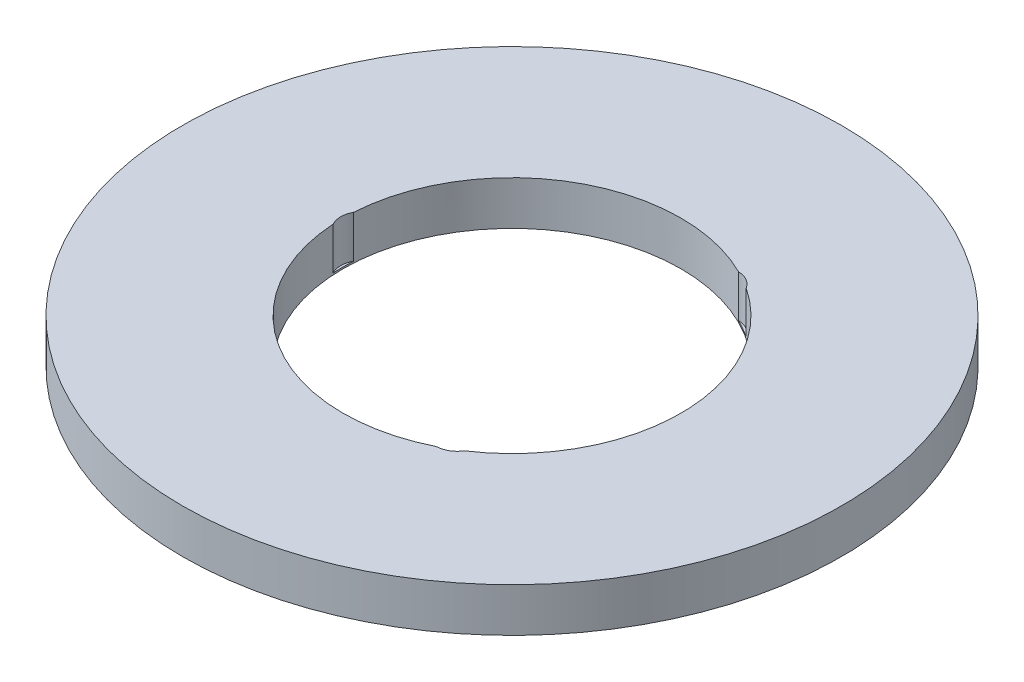
ISO-10303-21;
HEADER;
FILE_DESCRIPTION(('STEP AP214'),'2;1');
FILE_NAME('part.step','',(''),(''),'','','');
FILE_SCHEMA(('AUTOMOTIVE_DESIGN { 1 0 10303 214 1 1 1 1 }'));
ENDSEC;
DATA;
#1=APPLICATION_CONTEXT('core data for automotive mechanical design processes');
#2=APPLICATION_PROTOCOL_DEFINITION('international standard','automotive_design',2000,#1);
#3=PRODUCT_CONTEXT('',#1,'mechanical');
#4=PRODUCT('Part','Part','',(#3));
#5=PRODUCT_RELATED_PRODUCT_CATEGORY('part','',(#4));
#6=PRODUCT_DEFINITION_FORMATION('','',#4);
#7=PRODUCT_DEFINITION_CONTEXT('part definition',#1,'design');
#8=PRODUCT_DEFINITION('design','',#6,#7);
#9=PRODUCT_DEFINITION_SHAPE('','',#8);
#10=(LENGTH_UNIT() NAMED_UNIT(*) SI_UNIT(.MILLI.,.METRE.));
#11=(NAMED_UNIT(*) PLANE_ANGLE_UNIT() SI_UNIT($,.RADIAN.));
#12=(NAMED_UNIT(*) SI_UNIT($,.STERADIAN.) SOLID_ANGLE_UNIT());
#13=UNCERTAINTY_MEASURE_WITH_UNIT(LENGTH_MEASURE(1.E-05),#10,'distance_accuracy_value','');
#14=(GEOMETRIC_REPRESENTATION_CONTEXT(3) GLOBAL_UNCERTAINTY_ASSIGNED_CONTEXT((#13)) GLOBAL_UNIT_ASSIGNED_CONTEXT((#10,
#11,#12)) REPRESENTATION_CONTEXT('',''));
#15=CARTESIAN_POINT('',(0.,0.,0.));
#16=DIRECTION('',(0.,0.,1.));
#17=DIRECTION('',(1.,0.,0.));
#18=AXIS2_PLACEMENT_3D('',#15,#16,#17);
#19=CARTESIAN_POINT('',(0.,13.,0.));
#20=DIRECTION('',(0.,-1.,0.));
#21=DIRECTION('',(0.,0.,-1.));
#22=AXIS2_PLACEMENT_3D('',#19,#20,#21);
#23=CYLINDRICAL_SURFACE('',#22,97.5);
#24=CARTESIAN_POINT('',(0.,13.,0.));
#25=DIRECTION('',(0.,1.,0.));
#26=DIRECTION('',(0.,0.,1.));
#27=AXIS2_PLACEMENT_3D('',#24,#25,#26);
#28=CIRCLE('',#27,97.5);
#29=CARTESIAN_POINT('',(0.,13.,-97.5));
#30=VERTEX_POINT('',#29);
#31=EDGE_CURVE('E130',#30,#30,#28,.T.);
#32=CARTESIAN_POINT('',(0.,0.,0.));
#33=DIRECTION('',(0.,1.,0.));
#34=DIRECTION('',(0.,0.,1.));
#35=AXIS2_PLACEMENT_3D('',#32,#33,#34);
#36=CIRCLE('',#35,97.5);
#37=CARTESIAN_POINT('',(0.,0.,-97.5));
#38=VERTEX_POINT('',#37);
#39=EDGE_CURVE('E117',#38,#38,#36,.T.);
#40=CARTESIAN_POINT('',(0.,13.,-97.5));
#41=CARTESIAN_POINT('',(0.,12.8645833333333,-97.5));
#42=CARTESIAN_POINT('',(0.,12.7291666666667,-97.5));
#43=CARTESIAN_POINT('',(0.,12.4583333333333,-97.5));
#44=CARTESIAN_POINT('',(0.,12.3229166666667,-97.5));
#45=CARTESIAN_POINT('',(0.,12.0520833333333,-97.5));
#46=CARTESIAN_POINT('',(0.,11.9166666666667,-97.5));
#47=CARTESIAN_POINT('',(0.,11.6458333333333,-97.5));
#48=CARTESIAN_POINT('',(0.,11.5104166666667,-97.5));
#49=CARTESIAN_POINT('',(0.,11.2395833333333,-97.5));
#50=CARTESIAN_POINT('',(0.,11.1041666666667,-97.5));
#51=CARTESIAN_POINT('',(0.,10.8333333333333,-97.5));
#52=CARTESIAN_POINT('',(0.,10.6979166666667,-97.5));
#53=CARTESIAN_POINT('',(0.,10.4270833333333,-97.5));
#54=CARTESIAN_POINT('',(0.,10.2916666666667,-97.5));
#55=CARTESIAN_POINT('',(0.,10.0208333333333,-97.5));
#56=CARTESIAN_POINT('',(0.,9.88541666666667,-97.5));
#57=CARTESIAN_POINT('',(0.,9.61458333333333,-97.5));
#58=CARTESIAN_POINT('',(0.,9.47916666666667,-97.5));
#59=CARTESIAN_POINT('',(0.,9.20833333333333,-97.5));
#60=CARTESIAN_POINT('',(0.,9.07291666666667,-97.5));
#61=CARTESIAN_POINT('',(0.,8.80208333333333,-97.5));
#62=CARTESIAN_POINT('',(0.,8.66666666666667,-97.5));
#63=CARTESIAN_POINT('',(0.,8.39583333333333,-97.5));
#64=CARTESIAN_POINT('',(0.,8.26041666666667,-97.5));
#65=CARTESIAN_POINT('',(0.,7.98958333333333,-97.5));
#66=CARTESIAN_POINT('',(0.,7.85416666666667,-97.5));
#67=CARTESIAN_POINT('',(0.,7.58333333333333,-97.5));
#68=CARTESIAN_POINT('',(0.,7.44791666666667,-97.5));
#69=CARTESIAN_POINT('',(0.,7.17708333333333,-97.5));
#70=CARTESIAN_POINT('',(0.,7.04166666666667,-97.5));
#71=CARTESIAN_POINT('',(0.,6.77083333333333,-97.5));
#72=CARTESIAN_POINT('',(0.,6.63541666666667,-97.5));
#73=CARTESIAN_POINT('',(0.,6.36458333333333,-97.5));
#74=CARTESIAN_POINT('',(0.,6.22916666666667,-97.5));
#75=CARTESIAN_POINT('',(0.,5.95833333333333,-97.5));
#76=CARTESIAN_POINT('',(0.,5.82291666666667,-97.5));
#77=CARTESIAN_POINT('',(0.,5.55208333333333,-97.5));
#78=CARTESIAN_POINT('',(0.,5.41666666666667,-97.5));
#79=CARTESIAN_POINT('',(0.,5.14583333333333,-97.5));
#80=CARTESIAN_POINT('',(0.,5.01041666666667,-97.5));
#81=CARTESIAN_POINT('',(0.,4.73958333333333,-97.5));
#82=CARTESIAN_POINT('',(0.,4.60416666666667,-97.5));
#83=CARTESIAN_POINT('',(0.,4.33333333333333,-97.5));
#84=CARTESIAN_POINT('',(0.,4.19791666666667,-97.5));
#85=CARTESIAN_POINT('',(0.,3.92708333333333,-97.5));
#86=CARTESIAN_POINT('',(0.,3.79166666666667,-97.5));
#87=CARTESIAN_POINT('',(0.,3.52083333333333,-97.5));
#88=CARTESIAN_POINT('',(0.,3.38541666666667,-97.5));
#89=CARTESIAN_POINT('',(0.,3.11458333333333,-97.5));
#90=CARTESIAN_POINT('',(0.,2.97916666666667,-97.5));
#91=CARTESIAN_POINT('',(0.,2.70833333333333,-97.5));
#92=CARTESIAN_POINT('',(0.,2.57291666666667,-97.5));
#93=CARTESIAN_POINT('',(0.,2.30208333333333,-97.5));
#94=CARTESIAN_POINT('',(0.,2.16666666666667,-97.5));
#95=CARTESIAN_POINT('',(0.,1.89583333333333,-97.5));
#96=CARTESIAN_POINT('',(0.,1.76041666666667,-97.5));
#97=CARTESIAN_POINT('',(0.,1.48958333333333,-97.5));
#98=CARTESIAN_POINT('',(0.,1.35416666666667,-97.5));
#99=CARTESIAN_POINT('',(0.,1.08333333333333,-97.5));
#100=CARTESIAN_POINT('',(0.,0.947916666666667,-97.5));
#101=CARTESIAN_POINT('',(0.,0.677083333333334,-97.5));
#102=CARTESIAN_POINT('',(0.,0.541666666666667,-97.5));
#103=CARTESIAN_POINT('',(0.,0.270833333333334,-97.5));
#104=CARTESIAN_POINT('',(0.,0.135416666666667,-97.5));
#105=CARTESIAN_POINT('',(0.,0.,-97.5));
#106=B_SPLINE_CURVE_WITH_KNOTS('',3,(#40,#41,#42,#43,#44,#45,#46,#47,#48,#49,#50,#51,#52,#53,
#54,#55,#56,#57,#58,#59,#60,#61,#62,#63,#64,#65,#66,#67,#68,#69,#70,#71,#72,#73,#74,#75,#76,#77,
#78,#79,#80,#81,#82,#83,#84,#85,#86,#87,#88,#89,#90,#91,#92,#93,#94,#95,#96,#97,#98,#99,#100,
#101,#102,#103,#104,#105),.UNSPECIFIED.,.F.,.F.,(4,2,2,2,2,2,2,2,2,2,2,2,2,2,2,2,2,2,2,2,2,2,2,
2,2,2,2,2,2,2,2,2,4),(0.,0.406249999999999,0.812499999999999,1.21875,1.625,2.03125,2.4375,
2.84375,3.25,3.65625,4.0625,4.46875,4.875,5.28125,5.6875,6.09375,6.5,6.90625,7.3125,7.71875,
8.125,8.53125,8.9375,9.34375,9.75,10.15625,10.5625,10.96875,11.375,11.78125,12.1875,12.59375,
13.),.UNSPECIFIED.);
#107=EDGE_CURVE('BSEAM39',#30,#38,#106,.T.);
#108=ORIENTED_EDGE('',*,*,#31,.F.);
#109=ORIENTED_EDGE('',*,*,#39,.T.);
#110=ORIENTED_EDGE('',*,*,#107,.T.);
#111=ORIENTED_EDGE('',*,*,#107,.F.);
#112=EDGE_LOOP('',(#108,#110,#109,#111));
#113=FACE_BOUND('',#112,.T.);
#114=ADVANCED_FACE('F39',(#113),#23,.T.);
#115=CARTESIAN_POINT('',(0.,13.,0.));
#116=DIRECTION('',(0.,1.,0.));
#117=DIRECTION('',(0.,0.,1.));
#118=AXIS2_PLACEMENT_3D('',#115,#116,#117);
#119=PLANE('',#118);
#120=CARTESIAN_POINT('',(22.118594173977,13.,38.3105289013248));
#121=DIRECTION('',(0.,1.,0.));
#122=DIRECTION('',(0.866025403784436,0.,-0.500000000000004));
#123=AXIS2_PLACEMENT_3D('',#120,#121,#122);
#124=CIRCLE('',#123,6.43417313353536);
#125=CARTESIAN_POINT('',(22.3202723115172,13.,44.7415404734763));
#126=VERTEX_POINT('',#125);
#127=CARTESIAN_POINT('',(27.5871744987219,13.,41.7006930778982));
#128=VERTEX_POINT('',#127);
#129=EDGE_CURVE('E148',#126,#128,#124,.T.);
#130=ORIENTED_EDGE('',*,*,#129,.F.);
#131=CARTESIAN_POINT('',(0.,13.,0.));
#132=DIRECTION('',(0.,1.,0.));
#133=DIRECTION('',(0.,0.,1.));
#134=AXIS2_PLACEMENT_3D('',#131,#132,#133);
#135=CIRCLE('',#134,50.);
#136=CARTESIAN_POINT('',(-49.9074468102387,13.,3.04084739557801));
#137=VERTEX_POINT('',#136);
#138=EDGE_CURVE('E113',#137,#126,#135,.T.);
#139=ORIENTED_EDGE('',*,*,#138,.F.);
#140=CARTESIAN_POINT('',(-44.2371883479537,13.,0.));
#141=DIRECTION('',(0.,1.,0.));
#142=DIRECTION('',(0.,0.,1.));
#143=AXIS2_PLACEMENT_3D('',#140,#141,#142);
#144=CIRCLE('',#143,6.43417313353536);
#145=CARTESIAN_POINT('',(-49.9074468102387,13.,-3.04084739557801));
#146=VERTEX_POINT('',#145);
#147=EDGE_CURVE('E125',#146,#137,#144,.T.);
#148=ORIENTED_EDGE('',*,*,#147,.F.);
#149=CARTESIAN_POINT('',(22.3202723115166,13.,-44.7415404734766));
#150=VERTEX_POINT('',#149);
#151=EDGE_CURVE('E107',#150,#146,#135,.T.);
#152=ORIENTED_EDGE('',*,*,#151,.F.);
#153=CARTESIAN_POINT('',(22.1185941739765,13.,-38.3105289013251));
#154=DIRECTION('',(0.,1.,0.));
#155=DIRECTION('',(-0.866025403784443,0.,-0.499999999999992));
#156=AXIS2_PLACEMENT_3D('',#153,#154,#155);
#157=CIRCLE('',#156,6.43417313353536);
#158=CARTESIAN_POINT('',(27.5871744987213,13.,-41.7006930778986));
#159=VERTEX_POINT('',#158);
#160=EDGE_CURVE('E95',#159,#150,#157,.T.);
#161=ORIENTED_EDGE('',*,*,#160,.F.);
#162=EDGE_CURVE('E106',#128,#159,#135,.T.);
#163=ORIENTED_EDGE('',*,*,#162,.F.);
#164=EDGE_LOOP('',(#130,#139,#148,#152,#161,#163));
#165=FACE_BOUND('',#164,.T.);
#166=ORIENTED_EDGE('',*,*,#31,.T.);
#167=EDGE_LOOP('',(#166));
#168=FACE_BOUND('',#167,.T.);
#169=ADVANCED_FACE('F102',(#165,#168),#119,.T.);
#170=CARTESIAN_POINT('',(0.,0.,0.));
#171=DIRECTION('',(0.,1.,0.));
#172=DIRECTION('',(0.,0.,1.));
#173=AXIS2_PLACEMENT_3D('',#170,#171,#172);
#174=PLANE('',#173);
#175=CARTESIAN_POINT('',(0.,0.,0.));
#176=DIRECTION('',(0.,1.,0.));
#177=DIRECTION('',(0.,0.,1.));
#178=AXIS2_PLACEMENT_3D('',#175,#176,#177);
#179=CIRCLE('',#178,50.);
#180=CARTESIAN_POINT('',(0.,0.,50.));
#181=VERTEX_POINT('',#180);
#182=EDGE_CURVE('E118',#181,#181,#179,.T.);
#183=ORIENTED_EDGE('',*,*,#182,.T.);
#184=EDGE_LOOP('',(#183));
#185=FACE_BOUND('',#184,.T.);
#186=ORIENTED_EDGE('',*,*,#39,.F.);
#187=EDGE_LOOP('',(#186));
#188=FACE_BOUND('',#187,.T.);
#189=ADVANCED_FACE('F161',(#185,#188),#174,.F.);
#190=CARTESIAN_POINT('',(0.,13.,0.));
#191=DIRECTION('',(0.,-1.,0.));
#192=DIRECTION('',(0.,0.,-1.));
#193=AXIS2_PLACEMENT_3D('',#190,#191,#192);
#194=CYLINDRICAL_SURFACE('',#193,50.);
#195=DIRECTION('',(0.,1.,0.));
#196=VECTOR('',#195,1.);
#197=CARTESIAN_POINT('',(22.3202723115172,6.73601059932428,44.7415404734763));
#198=LINE('',#197,#196);
#199=CARTESIAN_POINT('',(22.3202723115172,0.472021198648568,44.7415404734763));
#200=VERTEX_POINT('',#199);
#201=EDGE_CURVE('E11',#200,#126,#198,.T.);
#202=ORIENTED_EDGE('',*,*,#201,.F.);
#203=CARTESIAN_POINT('',(0.,0.472021198648568,0.));
#204=DIRECTION('',(0.,1.,0.));
#205=DIRECTION('',(0.,0.,1.));
#206=AXIS2_PLACEMENT_3D('',#203,#204,#205);
#207=CIRCLE('',#206,50.);
#208=CARTESIAN_POINT('',(27.5871744987219,0.472021198648568,41.7006930778982));
#209=VERTEX_POINT('',#208);
#210=EDGE_CURVE('E100',#200,#209,#207,.T.);
#211=ORIENTED_EDGE('',*,*,#210,.T.);
#212=DIRECTION('',(0.,1.,0.));
#213=VECTOR('',#212,1.);
#214=CARTESIAN_POINT('',(27.5871744987219,6.73601059932428,41.7006930778982));
#215=LINE('',#214,#213);
#216=EDGE_CURVE('E46',#128,#209,#215,.F.);
#217=ORIENTED_EDGE('',*,*,#216,.F.);
#218=ORIENTED_EDGE('',*,*,#162,.T.);
#219=DIRECTION('',(0.,1.,0.));
#220=VECTOR('',#219,1.);
#221=CARTESIAN_POINT('',(27.5871744987213,6.73601059932428,-41.7006930778986));
#222=LINE('',#221,#220);
#223=CARTESIAN_POINT('',(27.5871744987213,0.472021198648568,-41.7006930778986));
#224=VERTEX_POINT('',#223);
#225=EDGE_CURVE('E90',#224,#159,#222,.T.);
#226=ORIENTED_EDGE('',*,*,#225,.F.);
#227=CARTESIAN_POINT('',(0.,0.472021198648568,0.));
#228=DIRECTION('',(0.,1.,0.));
#229=DIRECTION('',(0.,0.,1.));
#230=AXIS2_PLACEMENT_3D('',#227,#228,#229);
#231=CIRCLE('',#230,50.);
#232=CARTESIAN_POINT('',(22.3202723115166,0.472021198648568,-44.7415404734766));
#233=VERTEX_POINT('',#232);
#234=EDGE_CURVE('E143',#224,#233,#231,.T.);
#235=ORIENTED_EDGE('',*,*,#234,.T.);
#236=DIRECTION('',(0.,1.,0.));
#237=VECTOR('',#236,1.);
#238=CARTESIAN_POINT('',(22.3202723115166,6.73601059932428,-44.7415404734766));
#239=LINE('',#238,#237);
#240=EDGE_CURVE('E98',#150,#233,#239,.F.);
#241=ORIENTED_EDGE('',*,*,#240,.F.);
#242=ORIENTED_EDGE('',*,*,#151,.T.);
#243=DIRECTION('',(0.,1.,0.));
#244=VECTOR('',#243,1.);
#245=CARTESIAN_POINT('',(-49.9074468102387,6.73601059932428,-3.04084739557804));
#246=LINE('',#245,#244);
#247=CARTESIAN_POINT('',(-49.9074468102387,0.472021198648568,-3.04084739557801));
#248=VERTEX_POINT('',#247);
#249=EDGE_CURVE('E137',#248,#146,#246,.T.);
#250=ORIENTED_EDGE('',*,*,#249,.F.);
#251=CARTESIAN_POINT('',(0.,0.472021198648568,0.));
#252=DIRECTION('',(0.,1.,0.));
#253=DIRECTION('',(0.,0.,1.));
#254=AXIS2_PLACEMENT_3D('',#251,#252,#253);
#255=CIRCLE('',#254,50.);
#256=CARTESIAN_POINT('',(-49.9074468102387,0.472021198648568,3.04084739557801));
#257=VERTEX_POINT('',#256);
#258=EDGE_CURVE('E128',#248,#257,#255,.T.);
#259=ORIENTED_EDGE('',*,*,#258,.T.);
#260=DIRECTION('',(0.,1.,0.));
#261=VECTOR('',#260,1.);
#262=CARTESIAN_POINT('',(-49.9074468102387,6.73601059932428,3.04084739557804));
#263=LINE('',#262,#261);
#264=EDGE_CURVE('E134',#137,#257,#263,.F.);
#265=ORIENTED_EDGE('',*,*,#264,.F.);
#266=ORIENTED_EDGE('',*,*,#138,.T.);
#267=EDGE_LOOP('',(#202,#211,#217,#218,#226,#235,#241,#242,#250,#259,#265,#266));
#268=FACE_BOUND('',#267,.T.);
#269=ORIENTED_EDGE('',*,*,#182,.F.);
#270=EDGE_LOOP('',(#269));
#271=FACE_BOUND('',#270,.T.);
#272=ADVANCED_FACE('F115',(#268,#271),#194,.F.);
#273=CARTESIAN_POINT('',(-44.2371883479537,0.472021198648568,0.));
#274=DIRECTION('',(0.,1.,0.));
#275=DIRECTION('',(0.,0.,1.));
#276=AXIS2_PLACEMENT_3D('',#273,#274,#275);
#277=CYLINDRICAL_SURFACE('',#276,6.43417313353536);
#278=ORIENTED_EDGE('',*,*,#249,.T.);
#279=ORIENTED_EDGE('',*,*,#147,.T.);
#280=ORIENTED_EDGE('',*,*,#264,.T.);
#281=CARTESIAN_POINT('',(-44.2371883479537,0.472021198648568,0.));
#282=DIRECTION('',(0.,1.,0.));
#283=DIRECTION('',(0.,0.,1.));
#284=AXIS2_PLACEMENT_3D('',#281,#282,#283);
#285=CIRCLE('',#284,6.43417313353536);
#286=EDGE_CURVE('E127',#248,#257,#285,.T.);
#287=ORIENTED_EDGE('',*,*,#286,.F.);
#288=EDGE_LOOP('',(#278,#279,#280,#287));
#289=FACE_BOUND('',#288,.T.);
#290=ADVANCED_FACE('F175',(#289),#277,.F.);
#291=CARTESIAN_POINT('',(-44.2371883479537,0.472021198648568,0.));
#292=DIRECTION('',(0.,1.,0.));
#293=DIRECTION('',(0.,0.,1.));
#294=AXIS2_PLACEMENT_3D('',#291,#292,#293);
#295=PLANE('',#294);
#296=ORIENTED_EDGE('',*,*,#286,.T.);
#297=ORIENTED_EDGE('',*,*,#258,.F.);
#298=EDGE_LOOP('',(#296,#297));
#299=FACE_BOUND('',#298,.T.);
#300=ADVANCED_FACE('F176',(#299),#295,.T.);
#301=CARTESIAN_POINT('',(22.1185941739765,0.472021198648568,-38.3105289013251));
#302=DIRECTION('',(0.,1.,0.));
#303=DIRECTION('',(0.,0.,1.));
#304=AXIS2_PLACEMENT_3D('',#301,#302,#303);
#305=CYLINDRICAL_SURFACE('',#304,6.43417313353536);
#306=ORIENTED_EDGE('',*,*,#225,.T.);
#307=ORIENTED_EDGE('',*,*,#160,.T.);
#308=ORIENTED_EDGE('',*,*,#240,.T.);
#309=CARTESIAN_POINT('',(22.1185941739765,0.472021198648568,-38.3105289013251));
#310=DIRECTION('',(0.,1.,0.));
#311=DIRECTION('',(-0.866025403784443,0.,-0.499999999999992));
#312=AXIS2_PLACEMENT_3D('',#309,#310,#311);
#313=CIRCLE('',#312,6.43417313353536);
#314=EDGE_CURVE('E56',#224,#233,#313,.T.);
#315=ORIENTED_EDGE('',*,*,#314,.F.);
#316=EDGE_LOOP('',(#306,#307,#308,#315));
#317=FACE_BOUND('',#316,.T.);
#318=ADVANCED_FACE('F93',(#317),#305,.F.);
#319=CARTESIAN_POINT('',(22.1185941739765,0.472021198648568,-38.3105289013251));
#320=DIRECTION('',(0.,1.,0.));
#321=DIRECTION('',(-0.866025403784443,0.,-0.499999999999992));
#322=AXIS2_PLACEMENT_3D('',#319,#320,#321);
#323=PLANE('',#322);
#324=ORIENTED_EDGE('',*,*,#314,.T.);
#325=ORIENTED_EDGE('',*,*,#234,.F.);
#326=EDGE_LOOP('',(#324,#325));
#327=FACE_BOUND('',#326,.T.);
#328=ADVANCED_FACE('F153',(#327),#323,.T.);
#329=CARTESIAN_POINT('',(22.118594173977,0.472021198648568,38.3105289013248));
#330=DIRECTION('',(0.,1.,0.));
#331=DIRECTION('',(0.,0.,1.));
#332=AXIS2_PLACEMENT_3D('',#329,#330,#331);
#333=CYLINDRICAL_SURFACE('',#332,6.43417313353536);
#334=ORIENTED_EDGE('',*,*,#201,.T.);
#335=ORIENTED_EDGE('',*,*,#129,.T.);
#336=ORIENTED_EDGE('',*,*,#216,.T.);
#337=CARTESIAN_POINT('',(22.118594173977,0.472021198648568,38.3105289013248));
#338=DIRECTION('',(0.,1.,0.));
#339=DIRECTION('',(0.866025403784436,0.,-0.500000000000004));
#340=AXIS2_PLACEMENT_3D('',#337,#338,#339);
#341=CIRCLE('',#340,6.43417313353536);
#342=EDGE_CURVE('E55',#200,#209,#341,.T.);
#343=ORIENTED_EDGE('',*,*,#342,.F.);
#344=EDGE_LOOP('',(#334,#335,#336,#343));
#345=FACE_BOUND('',#344,.T.);
#346=ADVANCED_FACE('F144',(#345),#333,.F.);
#347=CARTESIAN_POINT('',(22.118594173977,0.472021198648568,38.3105289013248));
#348=DIRECTION('',(0.,1.,0.));
#349=DIRECTION('',(0.866025403784436,0.,-0.500000000000004));
#350=AXIS2_PLACEMENT_3D('',#347,#348,#349);
#351=PLANE('',#350);
#352=ORIENTED_EDGE('',*,*,#342,.T.);
#353=ORIENTED_EDGE('',*,*,#210,.F.);
#354=EDGE_LOOP('',(#352,#353));
#355=FACE_BOUND('',#354,.T.);
#356=ADVANCED_FACE('F150',(#355),#351,.T.);
#357=CLOSED_SHELL('',(#114,#169,#189,#272,#290,#300,#318,#328,#346,#356));
#358=MANIFOLD_SOLID_BREP('B2',#357);
#359=ADVANCED_BREP_SHAPE_REPRESENTATION('',(#18,#358),#14);
#360=SHAPE_DEFINITION_REPRESENTATION(#9,#359);
ENDSEC;
END-ISO-10303-21;
